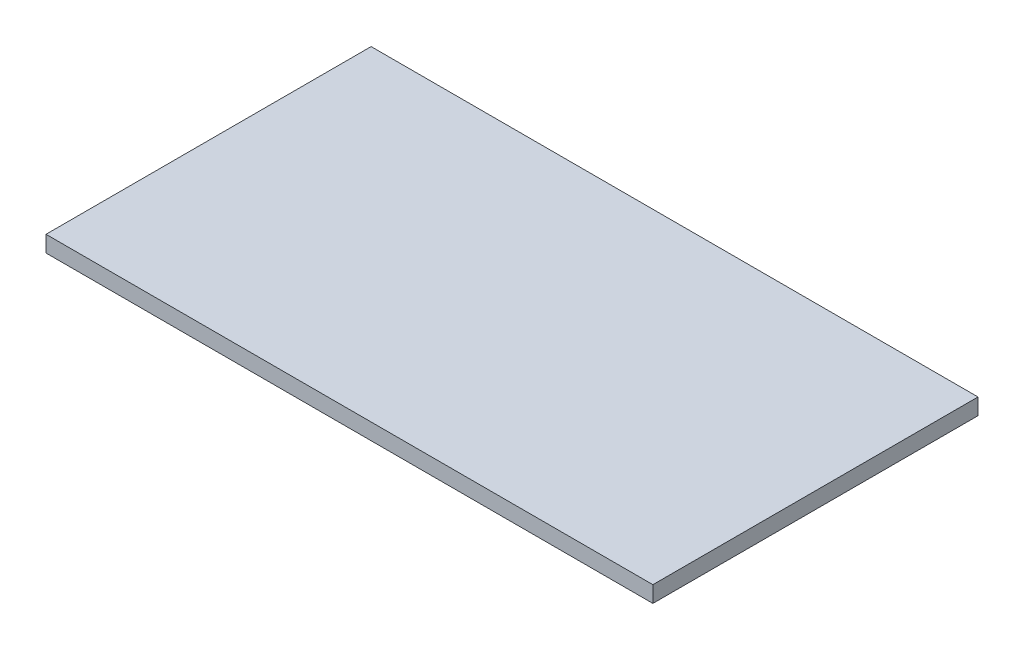
ISO-10303-21;
HEADER;
FILE_DESCRIPTION(('STEP AP214'),'2;1');
FILE_NAME('part.step','',(''),(''),'','','');
FILE_SCHEMA(('AUTOMOTIVE_DESIGN { 1 0 10303 214 1 1 1 1 }'));
ENDSEC;
DATA;
#1=APPLICATION_CONTEXT('core data for automotive mechanical design processes');
#2=APPLICATION_PROTOCOL_DEFINITION('international standard','automotive_design',2000,#1);
#3=PRODUCT_CONTEXT('',#1,'mechanical');
#4=PRODUCT('Part','Part','',(#3));
#5=PRODUCT_RELATED_PRODUCT_CATEGORY('part','',(#4));
#6=PRODUCT_DEFINITION_FORMATION('','',#4);
#7=PRODUCT_DEFINITION_CONTEXT('part definition',#1,'design');
#8=PRODUCT_DEFINITION('design','',#6,#7);
#9=PRODUCT_DEFINITION_SHAPE('','',#8);
#10=(LENGTH_UNIT() NAMED_UNIT(*) SI_UNIT(.MILLI.,.METRE.));
#11=(NAMED_UNIT(*) PLANE_ANGLE_UNIT() SI_UNIT($,.RADIAN.));
#12=(NAMED_UNIT(*) SI_UNIT($,.STERADIAN.) SOLID_ANGLE_UNIT());
#13=UNCERTAINTY_MEASURE_WITH_UNIT(LENGTH_MEASURE(1.E-05),#10,'distance_accuracy_value','');
#14=(GEOMETRIC_REPRESENTATION_CONTEXT(3) GLOBAL_UNCERTAINTY_ASSIGNED_CONTEXT((#13)) GLOBAL_UNIT_ASSIGNED_CONTEXT((#10,
#11,#12)) REPRESENTATION_CONTEXT('',''));
#15=CARTESIAN_POINT('',(0.,0.,0.));
#16=DIRECTION('',(0.,0.,1.));
#17=DIRECTION('',(1.,0.,0.));
#18=AXIS2_PLACEMENT_3D('',#15,#16,#17);
#19=CARTESIAN_POINT('',(-280.,15.,166.));
#20=DIRECTION('',(1.,0.,0.));
#21=DIRECTION('',(0.,0.,-1.));
#22=AXIS2_PLACEMENT_3D('',#19,#20,#21);
#23=PLANE('',#22);
#24=DIRECTION('',(0.,0.,1.));
#25=VECTOR('',#24,1.);
#26=CARTESIAN_POINT('',(-280.,0.,166.));
#27=LINE('',#26,#25);
#28=CARTESIAN_POINT('',(-280.,0.,-134.));
#29=VERTEX_POINT('',#28);
#30=CARTESIAN_POINT('',(-280.,0.,166.));
#31=VERTEX_POINT('',#30);
#32=EDGE_CURVE('E100',#29,#31,#27,.T.);
#33=ORIENTED_EDGE('',*,*,#32,.T.);
#34=DIRECTION('',(0.,-1.,0.));
#35=VECTOR('',#34,1.);
#36=CARTESIAN_POINT('',(-280.,15.,166.));
#37=LINE('',#36,#35);
#38=CARTESIAN_POINT('',(-280.,15.,166.));
#39=VERTEX_POINT('',#38);
#40=EDGE_CURVE('E11',#39,#31,#37,.T.);
#41=ORIENTED_EDGE('',*,*,#40,.F.);
#42=DIRECTION('',(0.,0.,1.));
#43=VECTOR('',#42,1.);
#44=CARTESIAN_POINT('',(-280.,15.,166.));
#45=LINE('',#44,#43);
#46=CARTESIAN_POINT('',(-280.,15.,-134.));
#47=VERTEX_POINT('',#46);
#48=EDGE_CURVE('E88',#47,#39,#45,.T.);
#49=ORIENTED_EDGE('',*,*,#48,.F.);
#50=DIRECTION('',(0.,-1.,0.));
#51=VECTOR('',#50,1.);
#52=CARTESIAN_POINT('',(-280.,15.,-134.));
#53=LINE('',#52,#51);
#54=EDGE_CURVE('E96',#47,#29,#53,.T.);
#55=ORIENTED_EDGE('',*,*,#54,.T.);
#56=EDGE_LOOP('',(#33,#41,#49,#55));
#57=FACE_BOUND('',#56,.T.);
#58=ADVANCED_FACE('F37',(#57),#23,.F.);
#59=CARTESIAN_POINT('',(-280.,15.,166.));
#60=DIRECTION('',(0.,0.,-1.));
#61=DIRECTION('',(-1.,0.,0.));
#62=AXIS2_PLACEMENT_3D('',#59,#60,#61);
#63=PLANE('',#62);
#64=DIRECTION('',(1.,0.,0.));
#65=VECTOR('',#64,1.);
#66=CARTESIAN_POINT('',(-280.,0.,166.));
#67=LINE('',#66,#65);
#68=CARTESIAN_POINT('',(280.,0.,166.));
#69=VERTEX_POINT('',#68);
#70=EDGE_CURVE('E92',#31,#69,#67,.T.);
#71=ORIENTED_EDGE('',*,*,#70,.T.);
#72=DIRECTION('',(0.,-1.,0.));
#73=VECTOR('',#72,1.);
#74=CARTESIAN_POINT('',(280.,15.,166.));
#75=LINE('',#74,#73);
#76=CARTESIAN_POINT('',(280.,15.,166.));
#77=VERTEX_POINT('',#76);
#78=EDGE_CURVE('E45',#77,#69,#75,.T.);
#79=ORIENTED_EDGE('',*,*,#78,.F.);
#80=DIRECTION('',(1.,0.,0.));
#81=VECTOR('',#80,1.);
#82=CARTESIAN_POINT('',(-280.,15.,166.));
#83=LINE('',#82,#81);
#84=EDGE_CURVE('E83',#39,#77,#83,.T.);
#85=ORIENTED_EDGE('',*,*,#84,.F.);
#86=ORIENTED_EDGE('',*,*,#40,.T.);
#87=EDGE_LOOP('',(#71,#79,#85,#86));
#88=FACE_BOUND('',#87,.T.);
#89=ADVANCED_FACE('F91',(#88),#63,.F.);
#90=CARTESIAN_POINT('',(280.,15.,166.));
#91=DIRECTION('',(-1.,0.,0.));
#92=DIRECTION('',(0.,0.,1.));
#93=AXIS2_PLACEMENT_3D('',#90,#91,#92);
#94=PLANE('',#93);
#95=DIRECTION('',(0.,0.,-1.));
#96=VECTOR('',#95,1.);
#97=CARTESIAN_POINT('',(280.,0.,166.));
#98=LINE('',#97,#96);
#99=CARTESIAN_POINT('',(280.,0.,-134.));
#100=VERTEX_POINT('',#99);
#101=EDGE_CURVE('E70',#69,#100,#98,.T.);
#102=ORIENTED_EDGE('',*,*,#101,.T.);
#103=DIRECTION('',(0.,-1.,0.));
#104=VECTOR('',#103,1.);
#105=CARTESIAN_POINT('',(280.,15.,-134.));
#106=LINE('',#105,#104);
#107=CARTESIAN_POINT('',(280.,15.,-134.));
#108=VERTEX_POINT('',#107);
#109=EDGE_CURVE('E93',#108,#100,#106,.T.);
#110=ORIENTED_EDGE('',*,*,#109,.F.);
#111=DIRECTION('',(0.,0.,-1.));
#112=VECTOR('',#111,1.);
#113=CARTESIAN_POINT('',(280.,15.,166.));
#114=LINE('',#113,#112);
#115=EDGE_CURVE('E86',#77,#108,#114,.T.);
#116=ORIENTED_EDGE('',*,*,#115,.F.);
#117=ORIENTED_EDGE('',*,*,#78,.T.);
#118=EDGE_LOOP('',(#102,#110,#116,#117));
#119=FACE_BOUND('',#118,.T.);
#120=ADVANCED_FACE('F94',(#119),#94,.F.);
#121=CARTESIAN_POINT('',(-280.,15.,-134.));
#122=DIRECTION('',(0.,0.,1.));
#123=DIRECTION('',(1.,0.,0.));
#124=AXIS2_PLACEMENT_3D('',#121,#122,#123);
#125=PLANE('',#124);
#126=DIRECTION('',(-1.,0.,0.));
#127=VECTOR('',#126,1.);
#128=CARTESIAN_POINT('',(-280.,0.,-134.));
#129=LINE('',#128,#127);
#130=EDGE_CURVE('E76',#100,#29,#129,.T.);
#131=ORIENTED_EDGE('',*,*,#130,.T.);
#132=ORIENTED_EDGE('',*,*,#54,.F.);
#133=DIRECTION('',(-1.,0.,0.));
#134=VECTOR('',#133,1.);
#135=CARTESIAN_POINT('',(-280.,15.,-134.));
#136=LINE('',#135,#134);
#137=EDGE_CURVE('E53',#108,#47,#136,.T.);
#138=ORIENTED_EDGE('',*,*,#137,.F.);
#139=ORIENTED_EDGE('',*,*,#109,.T.);
#140=EDGE_LOOP('',(#131,#132,#138,#139));
#141=FACE_BOUND('',#140,.T.);
#142=ADVANCED_FACE('F107',(#141),#125,.F.);
#143=CARTESIAN_POINT('',(0.,15.,0.));
#144=DIRECTION('',(0.,-1.,0.));
#145=DIRECTION('',(0.,0.,-1.));
#146=AXIS2_PLACEMENT_3D('',#143,#144,#145);
#147=PLANE('',#146);
#148=ORIENTED_EDGE('',*,*,#48,.T.);
#149=ORIENTED_EDGE('',*,*,#84,.T.);
#150=ORIENTED_EDGE('',*,*,#115,.T.);
#151=ORIENTED_EDGE('',*,*,#137,.T.);
#152=EDGE_LOOP('',(#148,#149,#150,#151));
#153=FACE_BOUND('',#152,.T.);
#154=ADVANCED_FACE('F84',(#153),#147,.F.);
#155=CARTESIAN_POINT('',(0.,0.,0.));
#156=DIRECTION('',(0.,-1.,0.));
#157=DIRECTION('',(0.,0.,-1.));
#158=AXIS2_PLACEMENT_3D('',#155,#156,#157);
#159=PLANE('',#158);
#160=ORIENTED_EDGE('',*,*,#32,.F.);
#161=ORIENTED_EDGE('',*,*,#130,.F.);
#162=ORIENTED_EDGE('',*,*,#101,.F.);
#163=ORIENTED_EDGE('',*,*,#70,.F.);
#164=EDGE_LOOP('',(#160,#161,#162,#163));
#165=FACE_BOUND('',#164,.T.);
#166=ADVANCED_FACE('F110',(#165),#159,.T.);
#167=CLOSED_SHELL('',(#58,#89,#120,#142,#154,#166));
#168=MANIFOLD_SOLID_BREP('B2',#167);
#169=ADVANCED_BREP_SHAPE_REPRESENTATION('',(#18,#168),#14);
#170=SHAPE_DEFINITION_REPRESENTATION(#9,#169);
ENDSEC;
END-ISO-10303-21;
